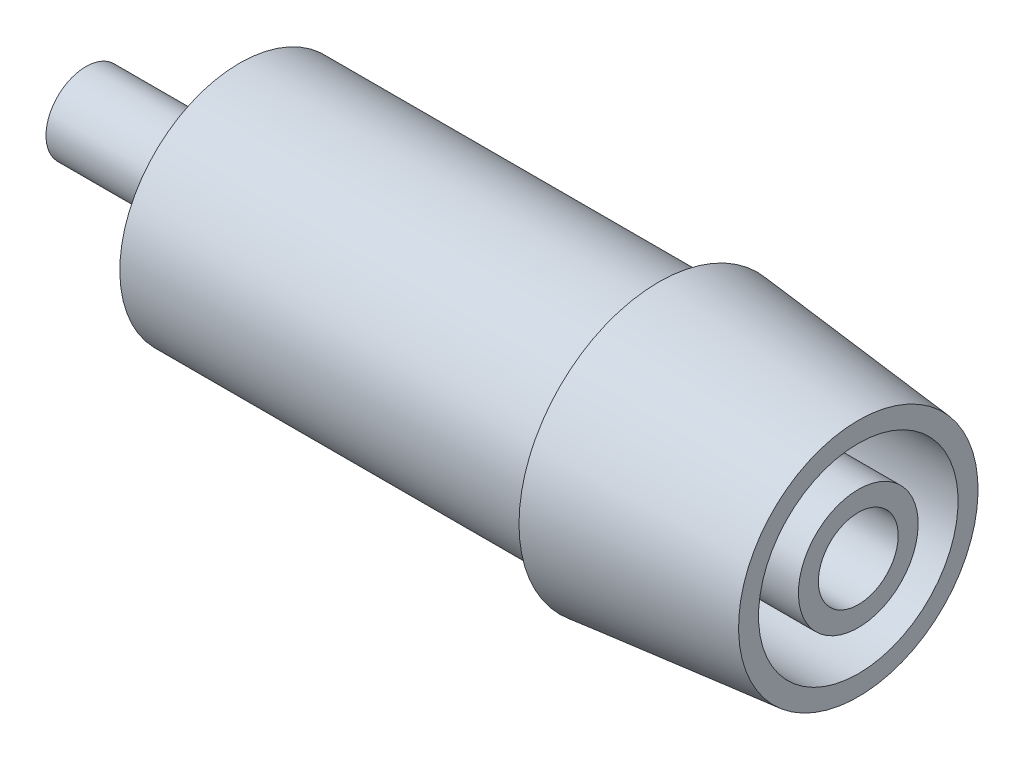
ISO-10303-21;
HEADER;
FILE_DESCRIPTION(('STEP AP214'),'2;1');
FILE_NAME('part.step','',(''),(''),'','','');
FILE_SCHEMA(('AUTOMOTIVE_DESIGN { 1 0 10303 214 1 1 1 1 }'));
ENDSEC;
DATA;
#1=APPLICATION_CONTEXT('core data for automotive mechanical design processes');
#2=APPLICATION_PROTOCOL_DEFINITION('international standard','automotive_design',2000,#1);
#3=PRODUCT_CONTEXT('',#1,'mechanical');
#4=PRODUCT('Part','Part','',(#3));
#5=PRODUCT_RELATED_PRODUCT_CATEGORY('part','',(#4));
#6=PRODUCT_DEFINITION_FORMATION('','',#4);
#7=PRODUCT_DEFINITION_CONTEXT('part definition',#1,'design');
#8=PRODUCT_DEFINITION('design','',#6,#7);
#9=PRODUCT_DEFINITION_SHAPE('','',#8);
#10=(LENGTH_UNIT() NAMED_UNIT(*) SI_UNIT(.MILLI.,.METRE.));
#11=(NAMED_UNIT(*) PLANE_ANGLE_UNIT() SI_UNIT($,.RADIAN.));
#12=(NAMED_UNIT(*) SI_UNIT($,.STERADIAN.) SOLID_ANGLE_UNIT());
#13=UNCERTAINTY_MEASURE_WITH_UNIT(LENGTH_MEASURE(1.E-05),#10,'distance_accuracy_value','');
#14=(GEOMETRIC_REPRESENTATION_CONTEXT(3) GLOBAL_UNCERTAINTY_ASSIGNED_CONTEXT((#13)) GLOBAL_UNIT_ASSIGNED_CONTEXT((#10,
#11,#12)) REPRESENTATION_CONTEXT('',''));
#15=CARTESIAN_POINT('',(0.,0.,0.));
#16=DIRECTION('',(0.,0.,1.));
#17=DIRECTION('',(1.,0.,0.));
#18=AXIS2_PLACEMENT_3D('',#15,#16,#17);
#19=CARTESIAN_POINT('',(0.,0.,0.));
#20=DIRECTION('',(-1.,0.,0.));
#21=DIRECTION('',(0.,-1.,0.));
#22=AXIS2_PLACEMENT_3D('',#19,#20,#21);
#23=PLANE('',#22);
#24=CARTESIAN_POINT('',(0.,0.,0.));
#25=DIRECTION('',(1.,0.,0.));
#26=DIRECTION('',(0.,1.,0.));
#27=AXIS2_PLACEMENT_3D('',#24,#25,#26);
#28=CIRCLE('',#27,2.);
#29=CARTESIAN_POINT('',(0.,2.,0.));
#30=VERTEX_POINT('',#29);
#31=EDGE_CURVE('E10',#30,#30,#28,.T.);
#32=ORIENTED_EDGE('',*,*,#31,.F.);
#33=EDGE_LOOP('',(#32));
#34=FACE_BOUND('',#33,.T.);
#35=ADVANCED_FACE('F34',(#34),#23,.T.);
#36=CARTESIAN_POINT('',(16.7,0.,0.));
#37=DIRECTION('',(1.,0.,0.));
#38=DIRECTION('',(0.,1.,0.));
#39=AXIS2_PLACEMENT_3D('',#36,#37,#38);
#40=CYLINDRICAL_SURFACE('',#39,2.);
#41=ORIENTED_EDGE('',*,*,#31,.T.);
#42=EDGE_LOOP('',(#41));
#43=FACE_BOUND('',#42,.T.);
#44=CARTESIAN_POINT('',(7.7,0.,0.));
#45=DIRECTION('',(1.,0.,0.));
#46=DIRECTION('',(0.,1.,0.));
#47=AXIS2_PLACEMENT_3D('',#44,#45,#46);
#48=CIRCLE('',#47,2.);
#49=CARTESIAN_POINT('',(7.7,2.,0.));
#50=VERTEX_POINT('',#49);
#51=EDGE_CURVE('E40',#50,#50,#48,.T.);
#52=ORIENTED_EDGE('',*,*,#51,.F.);
#53=EDGE_LOOP('',(#52));
#54=FACE_BOUND('',#53,.T.);
#55=ADVANCED_FACE('F94',(#43,#54),#40,.T.);
#56=CARTESIAN_POINT('',(7.7,2.,0.));
#57=DIRECTION('',(-1.,0.,0.));
#58=DIRECTION('',(0.,-1.,0.));
#59=AXIS2_PLACEMENT_3D('',#56,#57,#58);
#60=PLANE('',#59);
#61=ORIENTED_EDGE('',*,*,#51,.T.);
#62=EDGE_LOOP('',(#61));
#63=FACE_BOUND('',#62,.T.);
#64=CARTESIAN_POINT('',(7.7,0.,0.));
#65=DIRECTION('',(1.,0.,0.));
#66=DIRECTION('',(0.,1.,0.));
#67=AXIS2_PLACEMENT_3D('',#64,#65,#66);
#68=CIRCLE('',#67,6.);
#69=CARTESIAN_POINT('',(7.7,6.,0.));
#70=VERTEX_POINT('',#69);
#71=EDGE_CURVE('E44',#70,#70,#68,.T.);
#72=ORIENTED_EDGE('',*,*,#71,.F.);
#73=EDGE_LOOP('',(#72));
#74=FACE_BOUND('',#73,.T.);
#75=ADVANCED_FACE('F99',(#63,#74),#60,.T.);
#76=CARTESIAN_POINT('',(16.7,0.,0.));
#77=DIRECTION('',(1.,0.,0.));
#78=DIRECTION('',(0.,1.,0.));
#79=AXIS2_PLACEMENT_3D('',#76,#77,#78);
#80=CYLINDRICAL_SURFACE('',#79,6.00000000000001);
#81=ORIENTED_EDGE('',*,*,#71,.T.);
#82=EDGE_LOOP('',(#81));
#83=FACE_BOUND('',#82,.T.);
#84=CARTESIAN_POINT('',(28.7,0.,0.));
#85=DIRECTION('',(1.,0.,0.));
#86=DIRECTION('',(0.,1.,0.));
#87=AXIS2_PLACEMENT_3D('',#84,#85,#86);
#88=CIRCLE('',#87,6.00000000000001);
#89=CARTESIAN_POINT('',(28.7,6.,0.));
#90=VERTEX_POINT('',#89);
#91=EDGE_CURVE('E48',#90,#90,#88,.T.);
#92=ORIENTED_EDGE('',*,*,#91,.F.);
#93=EDGE_LOOP('',(#92));
#94=FACE_BOUND('',#93,.T.);
#95=ADVANCED_FACE('F103',(#83,#94),#80,.T.);
#96=CARTESIAN_POINT('',(28.7,6.,0.));
#97=DIRECTION('',(-1.,0.,0.));
#98=DIRECTION('',(0.,-1.,0.));
#99=AXIS2_PLACEMENT_3D('',#96,#97,#98);
#100=PLANE('',#99);
#101=ORIENTED_EDGE('',*,*,#91,.T.);
#102=EDGE_LOOP('',(#101));
#103=FACE_BOUND('',#102,.T.);
#104=CARTESIAN_POINT('',(28.7,0.,0.));
#105=DIRECTION('',(1.,0.,0.));
#106=DIRECTION('',(0.,1.,0.));
#107=AXIS2_PLACEMENT_3D('',#104,#105,#106);
#108=CIRCLE('',#107,7.00000000000001);
#109=CARTESIAN_POINT('',(28.7,7.,0.));
#110=VERTEX_POINT('',#109);
#111=EDGE_CURVE('E53',#110,#110,#108,.T.);
#112=ORIENTED_EDGE('',*,*,#111,.F.);
#113=EDGE_LOOP('',(#112));
#114=FACE_BOUND('',#113,.T.);
#115=ADVANCED_FACE('F109',(#103,#114),#100,.T.);
#116=CARTESIAN_POINT('',(38.7,0.,0.));
#117=DIRECTION('',(-1.,0.,0.));
#118=DIRECTION('',(0.,-1.,0.));
#119=AXIS2_PLACEMENT_3D('',#116,#117,#118);
#120=CONICAL_SURFACE('',#119,6.00000000000002,0.0996686524911609);
#121=ORIENTED_EDGE('',*,*,#111,.T.);
#122=EDGE_LOOP('',(#121));
#123=FACE_BOUND('',#122,.T.);
#124=CARTESIAN_POINT('',(38.7,0.,0.));
#125=DIRECTION('',(1.,0.,0.));
#126=DIRECTION('',(0.,1.,0.));
#127=AXIS2_PLACEMENT_3D('',#124,#125,#126);
#128=CIRCLE('',#127,6.00000000000002);
#129=CARTESIAN_POINT('',(38.7,6.00000000000001,0.));
#130=VERTEX_POINT('',#129);
#131=EDGE_CURVE('E56',#130,#130,#128,.T.);
#132=ORIENTED_EDGE('',*,*,#131,.F.);
#133=EDGE_LOOP('',(#132));
#134=FACE_BOUND('',#133,.T.);
#135=ADVANCED_FACE('F113',(#123,#134),#120,.T.);
#136=CARTESIAN_POINT('',(38.7,6.00000000000001,0.));
#137=DIRECTION('',(1.,0.,0.));
#138=DIRECTION('',(0.,1.,0.));
#139=AXIS2_PLACEMENT_3D('',#136,#137,#138);
#140=PLANE('',#139);
#141=ORIENTED_EDGE('',*,*,#131,.T.);
#142=EDGE_LOOP('',(#141));
#143=FACE_BOUND('',#142,.T.);
#144=CARTESIAN_POINT('',(38.7,0.,0.));
#145=DIRECTION('',(1.,0.,0.));
#146=DIRECTION('',(0.,1.,0.));
#147=AXIS2_PLACEMENT_3D('',#144,#145,#146);
#148=CIRCLE('',#147,5.00000000000002);
#149=CARTESIAN_POINT('',(38.7,5.,0.));
#150=VERTEX_POINT('',#149);
#151=EDGE_CURVE('E59',#150,#150,#148,.T.);
#152=ORIENTED_EDGE('',*,*,#151,.F.);
#153=EDGE_LOOP('',(#152));
#154=FACE_BOUND('',#153,.T.);
#155=ADVANCED_FACE('F117',(#143,#154),#140,.T.);
#156=CARTESIAN_POINT('',(16.7,0.,0.));
#157=DIRECTION('',(1.,0.,0.));
#158=DIRECTION('',(0.,1.,0.));
#159=AXIS2_PLACEMENT_3D('',#156,#157,#158);
#160=CYLINDRICAL_SURFACE('',#159,5.00000000000001);
#161=ORIENTED_EDGE('',*,*,#151,.T.);
#162=EDGE_LOOP('',(#161));
#163=FACE_BOUND('',#162,.T.);
#164=CARTESIAN_POINT('',(16.7,0.,0.));
#165=DIRECTION('',(1.,0.,0.));
#166=DIRECTION('',(0.,1.,0.));
#167=AXIS2_PLACEMENT_3D('',#164,#165,#166);
#168=CIRCLE('',#167,5.);
#169=CARTESIAN_POINT('',(16.7,4.99999999999999,0.));
#170=VERTEX_POINT('',#169);
#171=EDGE_CURVE('E62',#170,#170,#168,.T.);
#172=ORIENTED_EDGE('',*,*,#171,.F.);
#173=EDGE_LOOP('',(#172));
#174=FACE_BOUND('',#173,.T.);
#175=ADVANCED_FACE('F121',(#163,#174),#160,.F.);
#176=CARTESIAN_POINT('',(16.7,4.99999999999999,0.));
#177=DIRECTION('',(1.,0.,0.));
#178=DIRECTION('',(0.,1.,0.));
#179=AXIS2_PLACEMENT_3D('',#176,#177,#178);
#180=PLANE('',#179);
#181=ORIENTED_EDGE('',*,*,#171,.T.);
#182=EDGE_LOOP('',(#181));
#183=FACE_BOUND('',#182,.T.);
#184=CARTESIAN_POINT('',(16.7,0.,0.));
#185=DIRECTION('',(1.,0.,0.));
#186=DIRECTION('',(0.,1.,0.));
#187=AXIS2_PLACEMENT_3D('',#184,#185,#186);
#188=CIRCLE('',#187,3.);
#189=CARTESIAN_POINT('',(16.7,2.99999999999999,0.));
#190=VERTEX_POINT('',#189);
#191=EDGE_CURVE('E65',#190,#190,#188,.T.);
#192=ORIENTED_EDGE('',*,*,#191,.F.);
#193=EDGE_LOOP('',(#192));
#194=FACE_BOUND('',#193,.T.);
#195=ADVANCED_FACE('F125',(#183,#194),#180,.T.);
#196=CARTESIAN_POINT('',(16.7,0.,0.));
#197=DIRECTION('',(1.,0.,0.));
#198=DIRECTION('',(0.,1.,0.));
#199=AXIS2_PLACEMENT_3D('',#196,#197,#198);
#200=CYLINDRICAL_SURFACE('',#199,3.00000000000001);
#201=ORIENTED_EDGE('',*,*,#191,.T.);
#202=EDGE_LOOP('',(#201));
#203=FACE_BOUND('',#202,.T.);
#204=CARTESIAN_POINT('',(38.7,0.,0.));
#205=DIRECTION('',(1.,0.,0.));
#206=DIRECTION('',(0.,1.,0.));
#207=AXIS2_PLACEMENT_3D('',#204,#205,#206);
#208=CIRCLE('',#207,3.00000000000001);
#209=CARTESIAN_POINT('',(38.7,3.,0.));
#210=VERTEX_POINT('',#209);
#211=EDGE_CURVE('E68',#210,#210,#208,.T.);
#212=ORIENTED_EDGE('',*,*,#211,.F.);
#213=EDGE_LOOP('',(#212));
#214=FACE_BOUND('',#213,.T.);
#215=ADVANCED_FACE('F90',(#203,#214),#200,.T.);
#216=CARTESIAN_POINT('',(38.7,3.,0.));
#217=DIRECTION('',(1.,0.,0.));
#218=DIRECTION('',(0.,1.,0.));
#219=AXIS2_PLACEMENT_3D('',#216,#217,#218);
#220=PLANE('',#219);
#221=ORIENTED_EDGE('',*,*,#211,.T.);
#222=EDGE_LOOP('',(#221));
#223=FACE_BOUND('',#222,.T.);
#224=CARTESIAN_POINT('',(38.7,0.,0.));
#225=DIRECTION('',(1.,0.,0.));
#226=DIRECTION('',(0.,1.,0.));
#227=AXIS2_PLACEMENT_3D('',#224,#225,#226);
#228=CIRCLE('',#227,2.00000000000001);
#229=CARTESIAN_POINT('',(38.7,2.,0.));
#230=VERTEX_POINT('',#229);
#231=EDGE_CURVE('E71',#230,#230,#228,.T.);
#232=ORIENTED_EDGE('',*,*,#231,.F.);
#233=EDGE_LOOP('',(#232));
#234=FACE_BOUND('',#233,.T.);
#235=ADVANCED_FACE('F82',(#223,#234),#220,.T.);
#236=CARTESIAN_POINT('',(16.7,0.,0.));
#237=DIRECTION('',(1.,0.,0.));
#238=DIRECTION('',(0.,1.,0.));
#239=AXIS2_PLACEMENT_3D('',#236,#237,#238);
#240=CYLINDRICAL_SURFACE('',#239,2.00000000000001);
#241=ORIENTED_EDGE('',*,*,#231,.T.);
#242=EDGE_LOOP('',(#241));
#243=FACE_BOUND('',#242,.T.);
#244=CARTESIAN_POINT('',(16.7,0.,0.));
#245=DIRECTION('',(1.,0.,0.));
#246=DIRECTION('',(0.,1.,0.));
#247=AXIS2_PLACEMENT_3D('',#244,#245,#246);
#248=CIRCLE('',#247,2.);
#249=CARTESIAN_POINT('',(16.7,1.99999999999999,0.));
#250=VERTEX_POINT('',#249);
#251=EDGE_CURVE('E74',#250,#250,#248,.T.);
#252=ORIENTED_EDGE('',*,*,#251,.F.);
#253=EDGE_LOOP('',(#252));
#254=FACE_BOUND('',#253,.T.);
#255=ADVANCED_FACE('F80',(#243,#254),#240,.F.);
#256=CARTESIAN_POINT('',(16.7,1.99999999999999,0.));
#257=DIRECTION('',(1.,0.,0.));
#258=DIRECTION('',(0.,1.,0.));
#259=AXIS2_PLACEMENT_3D('',#256,#257,#258);
#260=PLANE('',#259);
#261=ORIENTED_EDGE('',*,*,#251,.T.);
#262=EDGE_LOOP('',(#261));
#263=FACE_BOUND('',#262,.T.);
#264=ADVANCED_FACE('F78',(#263),#260,.T.);
#265=CLOSED_SHELL('',(#35,#55,#75,#95,#115,#135,#155,#175,#195,#215,#235,#255,#264));
#266=MANIFOLD_SOLID_BREP('B2',#265);
#267=ADVANCED_BREP_SHAPE_REPRESENTATION('',(#18,#266),#14);
#268=SHAPE_DEFINITION_REPRESENTATION(#9,#267);
ENDSEC;
END-ISO-10303-21;
